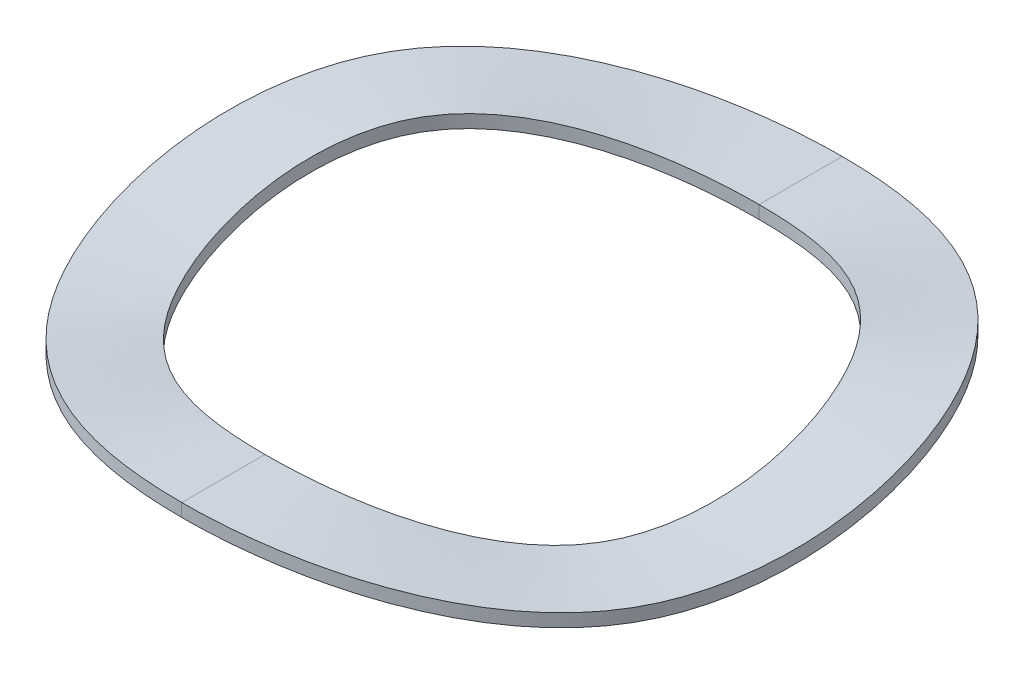
ISO-10303-21;
HEADER;
FILE_DESCRIPTION(('STEP AP214'),'2;1');
FILE_NAME('part.step','',(''),(''),'','','');
FILE_SCHEMA(('AUTOMOTIVE_DESIGN { 1 0 10303 214 1 1 1 1 }'));
ENDSEC;
DATA;
#1=APPLICATION_CONTEXT('core data for automotive mechanical design processes');
#2=APPLICATION_PROTOCOL_DEFINITION('international standard','automotive_design',2000,#1);
#3=PRODUCT_CONTEXT('',#1,'mechanical');
#4=PRODUCT('Part','Part','',(#3));
#5=PRODUCT_RELATED_PRODUCT_CATEGORY('part','',(#4));
#6=PRODUCT_DEFINITION_FORMATION('','',#4);
#7=PRODUCT_DEFINITION_CONTEXT('part definition',#1,'design');
#8=PRODUCT_DEFINITION('design','',#6,#7);
#9=PRODUCT_DEFINITION_SHAPE('','',#8);
#10=(LENGTH_UNIT() NAMED_UNIT(*) SI_UNIT(.MILLI.,.METRE.));
#11=(NAMED_UNIT(*) PLANE_ANGLE_UNIT() SI_UNIT($,.RADIAN.));
#12=(NAMED_UNIT(*) SI_UNIT($,.STERADIAN.) SOLID_ANGLE_UNIT());
#13=UNCERTAINTY_MEASURE_WITH_UNIT(LENGTH_MEASURE(1.E-05),#10,'distance_accuracy_value','');
#14=(GEOMETRIC_REPRESENTATION_CONTEXT(3) GLOBAL_UNCERTAINTY_ASSIGNED_CONTEXT((#13)) GLOBAL_UNIT_ASSIGNED_CONTEXT((#10,
#11,#12)) REPRESENTATION_CONTEXT('',''));
#15=CARTESIAN_POINT('',(0.,0.,0.));
#16=DIRECTION('',(0.,0.,1.));
#17=DIRECTION('',(1.,0.,0.));
#18=AXIS2_PLACEMENT_3D('',#15,#16,#17);
#19=CARTESIAN_POINT('',(0.,1.1938,9.652));
#20=CARTESIAN_POINT('',(-3.34355087893,1.1938,9.652));
#21=CARTESIAN_POINT('',(-10.0306526368,-1.1938,5.7912));
#22=CARTESIAN_POINT('',(-10.0306526368,2.3876,-5.7912));
#23=CARTESIAN_POINT('',(-3.34355087893,0.,-9.652));
#24=CARTESIAN_POINT('',(0.,0.,-9.652));
#25=CARTESIAN_POINT('',(0.,1.1938,10.7357333333));
#26=CARTESIAN_POINT('',(-3.71896711797,1.1938,10.7357333333));
#27=CARTESIAN_POINT('',(-11.1569013539,-1.1938,6.44144));
#28=CARTESIAN_POINT('',(-11.1569013539,2.3876,-6.44144));
#29=CARTESIAN_POINT('',(-3.71896711797,0.,-10.7357333333));
#30=CARTESIAN_POINT('',(0.,0.,-10.7357333333));
#31=CARTESIAN_POINT('',(0.,1.1938,11.8194666667));
#32=CARTESIAN_POINT('',(-4.09438335701,1.1938,11.8194666667));
#33=CARTESIAN_POINT('',(-12.283150071,-1.1938,7.09168));
#34=CARTESIAN_POINT('',(-12.283150071,2.3876,-7.09168));
#35=CARTESIAN_POINT('',(-4.09438335701,0.,-11.8194666667));
#36=CARTESIAN_POINT('',(0.,0.,-11.8194666667));
#37=CARTESIAN_POINT('',(0.,1.1938,12.9032));
#38=CARTESIAN_POINT('',(-4.46979959604,1.1938,12.9032));
#39=CARTESIAN_POINT('',(-13.4093987881,-1.1938,7.74192));
#40=CARTESIAN_POINT('',(-13.4093987881,2.3876,-7.74192));
#41=CARTESIAN_POINT('',(-4.46979959604,0.,-12.9032));
#42=CARTESIAN_POINT('',(0.,0.,-12.9032));
#43=B_SPLINE_SURFACE_WITH_KNOTS('',3,3,((#19,#20,#21,#22,#23,#24),(#25,#26,#27,#28,#29,#30),
(#31,#32,#33,#34,#35,#36),(#37,#38,#39,#40,#41,#42)),.UNSPECIFIED.,.F.,.F.,.F.,(4,4),(4,1,1,4),
(0.,3.58711466601),(37.4440665336,49.9254220448,62.406777556,74.8881330672),.UNSPECIFIED.);
#44=CARTESIAN_POINT('',(0.,1.1938,12.9032));
#45=CARTESIAN_POINT('',(-4.46979959604,1.1938,12.9032));
#46=CARTESIAN_POINT('',(-13.4093987881,-1.1938,7.74192));
#47=CARTESIAN_POINT('',(-13.4093987881,2.3876,-7.74192));
#48=CARTESIAN_POINT('',(-4.46979959604,0.,-12.9032));
#49=CARTESIAN_POINT('',(0.,0.,-12.9032));
#50=B_SPLINE_CURVE_WITH_KNOTS('',3,(#44,#45,#46,#47,#48,#49),.UNSPECIFIED.,.F.,.F.,(4,1,1,4),
(42.7114287966,56.9485717288,71.185714661,85.4228575932),.UNSPECIFIED.);
#51=CARTESIAN_POINT('',(0.,0.,-12.9032));
#52=VERTEX_POINT('',#51);
#53=CARTESIAN_POINT('',(0.,1.1938,12.9032));
#54=VERTEX_POINT('',#53);
#55=EDGE_CURVE('E23',#52,#54,#50,.F.);
#56=DIRECTION('',(0.,0.,-1.));
#57=VECTOR('',#56,1.);
#58=CARTESIAN_POINT('',(0.,0.,-11.2776));
#59=LINE('',#58,#57);
#60=CARTESIAN_POINT('',(0.,0.,-9.652));
#61=VERTEX_POINT('',#60);
#62=EDGE_CURVE('E69',#61,#52,#59,.T.);
#63=CARTESIAN_POINT('',(0.,1.1938,9.652));
#64=CARTESIAN_POINT('',(-3.34355087893,1.1938,9.652));
#65=CARTESIAN_POINT('',(-10.0306526368,-1.1938,5.7912));
#66=CARTESIAN_POINT('',(-10.0306526368,2.3876,-5.7912));
#67=CARTESIAN_POINT('',(-3.34355087893,0.,-9.652));
#68=CARTESIAN_POINT('',(0.,0.,-9.652));
#69=B_SPLINE_CURVE_WITH_KNOTS('',3,(#63,#64,#65,#66,#67,#68),.UNSPECIFIED.,.F.,.F.,(4,1,1,4),
(32.1847707732,42.9130276976,53.641284622,64.3695415464),.UNSPECIFIED.);
#70=CARTESIAN_POINT('',(0.,1.1938,9.652));
#71=VERTEX_POINT('',#70);
#72=EDGE_CURVE('E64',#71,#61,#69,.T.);
#73=DIRECTION('',(0.,0.,-1.));
#74=VECTOR('',#73,1.);
#75=CARTESIAN_POINT('',(0.,1.1938,11.2776));
#76=LINE('',#75,#74);
#77=EDGE_CURVE('E66',#54,#71,#76,.T.);
#78=ORIENTED_EDGE('',*,*,#55,.F.);
#79=ORIENTED_EDGE('',*,*,#62,.F.);
#80=ORIENTED_EDGE('',*,*,#72,.F.);
#81=ORIENTED_EDGE('',*,*,#77,.F.);
#82=EDGE_LOOP('',(#78,#79,#80,#81));
#83=FACE_BOUND('',#82,.T.);
#84=ADVANCED_FACE('F17',(#83),#43,.T.);
#85=CARTESIAN_POINT('',(0.,1.1938,12.9032));
#86=CARTESIAN_POINT('',(-4.46979959604,1.1938,12.9032));
#87=CARTESIAN_POINT('',(-13.4093987881,-1.1938,7.74192));
#88=CARTESIAN_POINT('',(-13.4093987881,2.3876,-7.74192));
#89=CARTESIAN_POINT('',(-4.46979959604,0.,-12.9032));
#90=CARTESIAN_POINT('',(0.,0.,-12.9032));
#91=CARTESIAN_POINT('',(0.,1.36313333333,12.9032));
#92=CARTESIAN_POINT('',(-4.46979959604,1.36313333333,12.9032));
#93=CARTESIAN_POINT('',(-13.4093987881,-1.02446666667,7.74192));
#94=CARTESIAN_POINT('',(-13.4093987881,2.55693333333,-7.74192));
#95=CARTESIAN_POINT('',(-4.46979959604,0.169333333333,-12.9032));
#96=CARTESIAN_POINT('',(0.,0.169333333333,-12.9032));
#97=CARTESIAN_POINT('',(0.,1.53246666667,12.9032));
#98=CARTESIAN_POINT('',(-4.46979959604,1.53246666667,12.9032));
#99=CARTESIAN_POINT('',(-13.4093987881,-0.855133333333,7.74192));
#100=CARTESIAN_POINT('',(-13.4093987881,2.72626666667,-7.74192));
#101=CARTESIAN_POINT('',(-4.46979959604,0.338666666667,-12.9032));
#102=CARTESIAN_POINT('',(0.,0.338666666667,-12.9032));
#103=CARTESIAN_POINT('',(0.,1.7018,12.9032));
#104=CARTESIAN_POINT('',(-4.46979959604,1.7018,12.9032));
#105=CARTESIAN_POINT('',(-13.4093987881,-0.6858,7.74192));
#106=CARTESIAN_POINT('',(-13.4093987881,2.8956,-7.74192));
#107=CARTESIAN_POINT('',(-4.46979959604,0.508,-12.9032));
#108=CARTESIAN_POINT('',(0.,0.508,-12.9032));
#109=B_SPLINE_SURFACE_WITH_KNOTS('',3,3,((#85,#86,#87,#88,#89,#90),(#91,#92,#93,#94,#95,#96),
(#97,#98,#99,#100,#101,#102),(#103,#104,#105,#106,#107,#108)),.UNSPECIFIED.,.F.,.F.,.F.,(4,4),
(4,1,1,4),(0.,0.508),(42.7114287966,56.9485717288,71.185714661,85.4228575932),.UNSPECIFIED.);
#110=CARTESIAN_POINT('',(0.,1.7018,12.9032));
#111=CARTESIAN_POINT('',(-4.46979959604,1.7018,12.9032));
#112=CARTESIAN_POINT('',(-13.4093987881,-0.6858,7.74192));
#113=CARTESIAN_POINT('',(-13.4093987881,2.8956,-7.74192));
#114=CARTESIAN_POINT('',(-4.46979959604,0.508,-12.9032));
#115=CARTESIAN_POINT('',(0.,0.508,-12.9032));
#116=B_SPLINE_CURVE_WITH_KNOTS('',3,(#110,#111,#112,#113,#114,#115),.UNSPECIFIED.,.F.,.F.,(4,1,
1,4),(37.4440665336,49.9254220448,62.406777556,74.8881330672),.UNSPECIFIED.);
#117=CARTESIAN_POINT('',(0.,0.508,-12.9032));
#118=VERTEX_POINT('',#117);
#119=CARTESIAN_POINT('',(0.,1.7018,12.9032));
#120=VERTEX_POINT('',#119);
#121=EDGE_CURVE('E106',#118,#120,#116,.F.);
#122=DIRECTION('',(0.,1.,0.));
#123=VECTOR('',#122,1.);
#124=CARTESIAN_POINT('',(0.,0.254,-12.9032));
#125=LINE('',#124,#123);
#126=EDGE_CURVE('E100',#52,#118,#125,.T.);
#127=DIRECTION('',(0.,-1.,0.));
#128=VECTOR('',#127,1.);
#129=CARTESIAN_POINT('',(0.,1.4478,12.9032));
#130=LINE('',#129,#128);
#131=EDGE_CURVE('E95',#120,#54,#130,.T.);
#132=ORIENTED_EDGE('',*,*,#121,.F.);
#133=ORIENTED_EDGE('',*,*,#126,.F.);
#134=ORIENTED_EDGE('',*,*,#55,.T.);
#135=ORIENTED_EDGE('',*,*,#131,.F.);
#136=EDGE_LOOP('',(#132,#133,#134,#135));
#137=FACE_BOUND('',#136,.T.);
#138=ADVANCED_FACE('F150',(#137),#109,.T.);
#139=CARTESIAN_POINT('',(0.,1.7018,9.652));
#140=CARTESIAN_POINT('',(-3.34355087893,1.7018,9.652));
#141=CARTESIAN_POINT('',(-10.0306526368,-0.6858,5.7912));
#142=CARTESIAN_POINT('',(-10.0306526368,2.8956,-5.7912));
#143=CARTESIAN_POINT('',(-3.34355087893,0.508,-9.652));
#144=CARTESIAN_POINT('',(0.,0.508,-9.652));
#145=CARTESIAN_POINT('',(0.,1.53246666667,9.652));
#146=CARTESIAN_POINT('',(-3.34355087893,1.53246666667,9.652));
#147=CARTESIAN_POINT('',(-10.0306526368,-0.855133333333,5.7912));
#148=CARTESIAN_POINT('',(-10.0306526368,2.72626666667,-5.7912));
#149=CARTESIAN_POINT('',(-3.34355087893,0.338666666667,-9.652));
#150=CARTESIAN_POINT('',(0.,0.338666666667,-9.652));
#151=CARTESIAN_POINT('',(0.,1.36313333333,9.652));
#152=CARTESIAN_POINT('',(-3.34355087893,1.36313333333,9.652));
#153=CARTESIAN_POINT('',(-10.0306526368,-1.02446666667,5.7912));
#154=CARTESIAN_POINT('',(-10.0306526368,2.55693333333,-5.7912));
#155=CARTESIAN_POINT('',(-3.34355087893,0.169333333333,-9.652));
#156=CARTESIAN_POINT('',(0.,0.169333333333,-9.652));
#157=CARTESIAN_POINT('',(0.,1.1938,9.652));
#158=CARTESIAN_POINT('',(-3.34355087893,1.1938,9.652));
#159=CARTESIAN_POINT('',(-10.0306526368,-1.1938,5.7912));
#160=CARTESIAN_POINT('',(-10.0306526368,2.3876,-5.7912));
#161=CARTESIAN_POINT('',(-3.34355087893,0.,-9.652));
#162=CARTESIAN_POINT('',(0.,0.,-9.652));
#163=B_SPLINE_SURFACE_WITH_KNOTS('',3,3,((#139,#140,#141,#142,#143,#144),(#145,#146,#147,#148,
#149,#150),(#151,#152,#153,#154,#155,#156),(#157,#158,#159,#160,#161,#162)),.UNSPECIFIED.,.F.,
.F.,.F.,(4,4),(4,1,1,4),(0.,0.508),(32.1847707732,42.9130276976,53.641284622,64.3695415464),.UNSPECIFIED.);
#164=DIRECTION('',(0.,1.,0.));
#165=VECTOR('',#164,1.);
#166=CARTESIAN_POINT('',(0.,0.254,-9.652));
#167=LINE('',#166,#165);
#168=CARTESIAN_POINT('',(0.,0.508,-9.652));
#169=VERTEX_POINT('',#168);
#170=EDGE_CURVE('E40',#61,#169,#167,.T.);
#171=CARTESIAN_POINT('',(0.,1.7018,9.652));
#172=CARTESIAN_POINT('',(-3.34355087893,1.7018,9.652));
#173=CARTESIAN_POINT('',(-10.0306526368,-0.6858,5.7912));
#174=CARTESIAN_POINT('',(-10.0306526368,2.8956,-5.7912));
#175=CARTESIAN_POINT('',(-3.34355087893,0.508,-9.652));
#176=CARTESIAN_POINT('',(0.,0.508,-9.652));
#177=B_SPLINE_CURVE_WITH_KNOTS('',3,(#171,#172,#173,#174,#175,#176),.UNSPECIFIED.,.F.,.F.,(4,1,
1,4),(37.4440665336,49.9254220448,62.406777556,74.8881330672),.UNSPECIFIED.);
#178=CARTESIAN_POINT('',(0.,1.7018,9.652));
#179=VERTEX_POINT('',#178);
#180=EDGE_CURVE('E77',#179,#169,#177,.T.);
#181=DIRECTION('',(0.,-1.,0.));
#182=VECTOR('',#181,1.);
#183=CARTESIAN_POINT('',(0.,1.4478,9.652));
#184=LINE('',#183,#182);
#185=EDGE_CURVE('E71',#179,#71,#184,.T.);
#186=ORIENTED_EDGE('',*,*,#72,.T.);
#187=ORIENTED_EDGE('',*,*,#170,.T.);
#188=ORIENTED_EDGE('',*,*,#180,.F.);
#189=ORIENTED_EDGE('',*,*,#185,.T.);
#190=EDGE_LOOP('',(#186,#187,#188,#189));
#191=FACE_BOUND('',#190,.T.);
#192=ADVANCED_FACE('F85',(#191),#163,.T.);
#193=CARTESIAN_POINT('',(0.,0.,-9.652));
#194=CARTESIAN_POINT('',(3.34355087893,0.,-9.652));
#195=CARTESIAN_POINT('',(10.0306526368,2.3876,-5.7912));
#196=CARTESIAN_POINT('',(10.0306526368,-1.1938,5.7912));
#197=CARTESIAN_POINT('',(3.34355087893,1.1938,9.652));
#198=CARTESIAN_POINT('',(0.,1.1938,9.652));
#199=CARTESIAN_POINT('',(0.,0.,-10.7357333333));
#200=CARTESIAN_POINT('',(3.71896711797,0.,-10.7357333333));
#201=CARTESIAN_POINT('',(11.1569013539,2.3876,-6.44144));
#202=CARTESIAN_POINT('',(11.1569013539,-1.1938,6.44144));
#203=CARTESIAN_POINT('',(3.71896711797,1.1938,10.7357333333));
#204=CARTESIAN_POINT('',(0.,1.1938,10.7357333333));
#205=CARTESIAN_POINT('',(0.,0.,-11.8194666667));
#206=CARTESIAN_POINT('',(4.09438335701,0.,-11.8194666667));
#207=CARTESIAN_POINT('',(12.283150071,2.3876,-7.09168));
#208=CARTESIAN_POINT('',(12.283150071,-1.1938,7.09168));
#209=CARTESIAN_POINT('',(4.09438335701,1.1938,11.8194666667));
#210=CARTESIAN_POINT('',(0.,1.1938,11.8194666667));
#211=CARTESIAN_POINT('',(0.,0.,-12.9032));
#212=CARTESIAN_POINT('',(4.46979959604,0.,-12.9032));
#213=CARTESIAN_POINT('',(13.4093987881,2.3876,-7.74192));
#214=CARTESIAN_POINT('',(13.4093987881,-1.1938,7.74192));
#215=CARTESIAN_POINT('',(4.46979959604,1.1938,12.9032));
#216=CARTESIAN_POINT('',(0.,1.1938,12.9032));
#217=B_SPLINE_SURFACE_WITH_KNOTS('',3,3,((#193,#194,#195,#196,#197,#198),(#199,#200,#201,#202,
#203,#204),(#205,#206,#207,#208,#209,#210),(#211,#212,#213,#214,#215,#216)),.UNSPECIFIED.,.F.,
.F.,.F.,(4,4),(4,1,1,4),(0.,3.58711466601),(0.,12.4813555112,24.9627110224,37.4440665336),.UNSPECIFIED.);
#218=CARTESIAN_POINT('',(0.,0.,-12.9032));
#219=CARTESIAN_POINT('',(4.46979959604,0.,-12.9032));
#220=CARTESIAN_POINT('',(13.4093987881,2.3876,-7.74192));
#221=CARTESIAN_POINT('',(13.4093987881,-1.1938,7.74192));
#222=CARTESIAN_POINT('',(4.46979959604,1.1938,12.9032));
#223=CARTESIAN_POINT('',(0.,1.1938,12.9032));
#224=B_SPLINE_CURVE_WITH_KNOTS('',3,(#218,#219,#220,#221,#222,#223),.UNSPECIFIED.,.F.,.F.,(4,1,
1,4),(0.,14.2371429322,28.4742858644,42.7114287966),.UNSPECIFIED.);
#225=EDGE_CURVE('E82',#54,#52,#224,.F.);
#226=CARTESIAN_POINT('',(0.,0.,-9.652));
#227=CARTESIAN_POINT('',(3.34355087893,0.,-9.652));
#228=CARTESIAN_POINT('',(10.0306526368,2.3876,-5.7912));
#229=CARTESIAN_POINT('',(10.0306526368,-1.1938,5.7912));
#230=CARTESIAN_POINT('',(3.34355087893,1.1938,9.652));
#231=CARTESIAN_POINT('',(0.,1.1938,9.652));
#232=B_SPLINE_CURVE_WITH_KNOTS('',3,(#226,#227,#228,#229,#230,#231),.UNSPECIFIED.,.F.,.F.,(4,1,
1,4),(0.,10.7282569244,21.4565138488,32.1847707732),.UNSPECIFIED.);
#233=EDGE_CURVE('E73',#61,#71,#232,.T.);
#234=ORIENTED_EDGE('',*,*,#62,.T.);
#235=ORIENTED_EDGE('',*,*,#225,.F.);
#236=ORIENTED_EDGE('',*,*,#77,.T.);
#237=ORIENTED_EDGE('',*,*,#233,.F.);
#238=EDGE_LOOP('',(#234,#235,#236,#237));
#239=FACE_BOUND('',#238,.T.);
#240=ADVANCED_FACE('F80',(#239),#217,.T.);
#241=CARTESIAN_POINT('',(0.,0.,-12.9032));
#242=CARTESIAN_POINT('',(4.46979959604,0.,-12.9032));
#243=CARTESIAN_POINT('',(13.4093987881,2.3876,-7.74192));
#244=CARTESIAN_POINT('',(13.4093987881,-1.1938,7.74192));
#245=CARTESIAN_POINT('',(4.46979959604,1.1938,12.9032));
#246=CARTESIAN_POINT('',(0.,1.1938,12.9032));
#247=CARTESIAN_POINT('',(0.,0.169333333333,-12.9032));
#248=CARTESIAN_POINT('',(4.46979959604,0.169333333333,-12.9032));
#249=CARTESIAN_POINT('',(13.4093987881,2.55693333333,-7.74192));
#250=CARTESIAN_POINT('',(13.4093987881,-1.02446666667,7.74192));
#251=CARTESIAN_POINT('',(4.46979959604,1.36313333333,12.9032));
#252=CARTESIAN_POINT('',(0.,1.36313333333,12.9032));
#253=CARTESIAN_POINT('',(0.,0.338666666667,-12.9032));
#254=CARTESIAN_POINT('',(4.46979959604,0.338666666667,-12.9032));
#255=CARTESIAN_POINT('',(13.4093987881,2.72626666667,-7.74192));
#256=CARTESIAN_POINT('',(13.4093987881,-0.855133333333,7.74192));
#257=CARTESIAN_POINT('',(4.46979959604,1.53246666667,12.9032));
#258=CARTESIAN_POINT('',(0.,1.53246666667,12.9032));
#259=CARTESIAN_POINT('',(0.,0.508,-12.9032));
#260=CARTESIAN_POINT('',(4.46979959604,0.508,-12.9032));
#261=CARTESIAN_POINT('',(13.4093987881,2.8956,-7.74192));
#262=CARTESIAN_POINT('',(13.4093987881,-0.6858,7.74192));
#263=CARTESIAN_POINT('',(4.46979959604,1.7018,12.9032));
#264=CARTESIAN_POINT('',(0.,1.7018,12.9032));
#265=B_SPLINE_SURFACE_WITH_KNOTS('',3,3,((#241,#242,#243,#244,#245,#246),(#247,#248,#249,#250,
#251,#252),(#253,#254,#255,#256,#257,#258),(#259,#260,#261,#262,#263,#264)),.UNSPECIFIED.,.F.,
.F.,.F.,(4,4),(4,1,1,4),(0.,0.508),(0.,14.2371429322,28.4742858644,42.7114287966),.UNSPECIFIED.);
#266=CARTESIAN_POINT('',(0.,0.508,-12.9032));
#267=CARTESIAN_POINT('',(4.46979959604,0.508,-12.9032));
#268=CARTESIAN_POINT('',(13.4093987881,2.8956,-7.74192));
#269=CARTESIAN_POINT('',(13.4093987881,-0.6858,7.74192));
#270=CARTESIAN_POINT('',(4.46979959604,1.7018,12.9032));
#271=CARTESIAN_POINT('',(0.,1.7018,12.9032));
#272=B_SPLINE_CURVE_WITH_KNOTS('',3,(#266,#267,#268,#269,#270,#271),.UNSPECIFIED.,.F.,.F.,(4,1,
1,4),(0.,12.4813555112,24.9627110224,37.4440665336),.UNSPECIFIED.);
#273=EDGE_CURVE('E127',#120,#118,#272,.F.);
#274=ORIENTED_EDGE('',*,*,#126,.T.);
#275=ORIENTED_EDGE('',*,*,#273,.F.);
#276=ORIENTED_EDGE('',*,*,#131,.T.);
#277=ORIENTED_EDGE('',*,*,#225,.T.);
#278=EDGE_LOOP('',(#274,#275,#276,#277));
#279=FACE_BOUND('',#278,.T.);
#280=ADVANCED_FACE('F149',(#279),#265,.T.);
#281=CARTESIAN_POINT('',(0.,1.7018,12.9032));
#282=CARTESIAN_POINT('',(-4.46979959604,1.7018,12.9032));
#283=CARTESIAN_POINT('',(-13.4093987881,-0.6858,7.74192));
#284=CARTESIAN_POINT('',(-13.4093987881,2.8956,-7.74192));
#285=CARTESIAN_POINT('',(-4.46979959604,0.508,-12.9032));
#286=CARTESIAN_POINT('',(0.,0.508,-12.9032));
#287=CARTESIAN_POINT('',(0.,1.7018,11.8194666667));
#288=CARTESIAN_POINT('',(-4.09438335701,1.7018,11.8194666667));
#289=CARTESIAN_POINT('',(-12.283150071,-0.6858,7.09168));
#290=CARTESIAN_POINT('',(-12.283150071,2.8956,-7.09168));
#291=CARTESIAN_POINT('',(-4.09438335701,0.508,-11.8194666667));
#292=CARTESIAN_POINT('',(0.,0.508,-11.8194666667));
#293=CARTESIAN_POINT('',(0.,1.7018,10.7357333333));
#294=CARTESIAN_POINT('',(-3.71896711797,1.7018,10.7357333333));
#295=CARTESIAN_POINT('',(-11.1569013539,-0.6858,6.44144));
#296=CARTESIAN_POINT('',(-11.1569013539,2.8956,-6.44144));
#297=CARTESIAN_POINT('',(-3.71896711797,0.508,-10.7357333333));
#298=CARTESIAN_POINT('',(0.,0.508,-10.7357333333));
#299=CARTESIAN_POINT('',(0.,1.7018,9.652));
#300=CARTESIAN_POINT('',(-3.34355087893,1.7018,9.652));
#301=CARTESIAN_POINT('',(-10.0306526368,-0.6858,5.7912));
#302=CARTESIAN_POINT('',(-10.0306526368,2.8956,-5.7912));
#303=CARTESIAN_POINT('',(-3.34355087893,0.508,-9.652));
#304=CARTESIAN_POINT('',(0.,0.508,-9.652));
#305=B_SPLINE_SURFACE_WITH_KNOTS('',3,3,((#281,#282,#283,#284,#285,#286),(#287,#288,#289,#290,
#291,#292),(#293,#294,#295,#296,#297,#298),(#299,#300,#301,#302,#303,#304)),.UNSPECIFIED.,.F.,
.F.,.F.,(4,4),(4,1,1,4),(0.,3.58711466601),(37.4440665336,49.9254220448,62.406777556,
74.8881330672),.UNSPECIFIED.);
#306=DIRECTION('',(0.,0.,1.));
#307=VECTOR('',#306,1.);
#308=CARTESIAN_POINT('',(0.,0.508,-11.2776));
#309=LINE('',#308,#307);
#310=EDGE_CURVE('E31',#118,#169,#309,.T.);
#311=DIRECTION('',(0.,0.,1.));
#312=VECTOR('',#311,1.);
#313=CARTESIAN_POINT('',(0.,1.7018,11.2776));
#314=LINE('',#313,#312);
#315=EDGE_CURVE('E76',#179,#120,#314,.T.);
#316=ORIENTED_EDGE('',*,*,#180,.T.);
#317=ORIENTED_EDGE('',*,*,#310,.F.);
#318=ORIENTED_EDGE('',*,*,#121,.T.);
#319=ORIENTED_EDGE('',*,*,#315,.F.);
#320=EDGE_LOOP('',(#316,#317,#318,#319));
#321=FACE_BOUND('',#320,.T.);
#322=ADVANCED_FACE('F145',(#321),#305,.T.);
#323=CARTESIAN_POINT('',(0.,0.508,-9.652));
#324=CARTESIAN_POINT('',(3.34355087893,0.508,-9.652));
#325=CARTESIAN_POINT('',(10.0306526368,2.8956,-5.7912));
#326=CARTESIAN_POINT('',(10.0306526368,-0.6858,5.7912));
#327=CARTESIAN_POINT('',(3.34355087893,1.7018,9.652));
#328=CARTESIAN_POINT('',(0.,1.7018,9.652));
#329=CARTESIAN_POINT('',(0.,0.338666666667,-9.652));
#330=CARTESIAN_POINT('',(3.34355087893,0.338666666667,-9.652));
#331=CARTESIAN_POINT('',(10.0306526368,2.72626666667,-5.7912));
#332=CARTESIAN_POINT('',(10.0306526368,-0.855133333333,5.7912));
#333=CARTESIAN_POINT('',(3.34355087893,1.53246666667,9.652));
#334=CARTESIAN_POINT('',(0.,1.53246666667,9.652));
#335=CARTESIAN_POINT('',(0.,0.169333333333,-9.652));
#336=CARTESIAN_POINT('',(3.34355087893,0.169333333333,-9.652));
#337=CARTESIAN_POINT('',(10.0306526368,2.55693333333,-5.7912));
#338=CARTESIAN_POINT('',(10.0306526368,-1.02446666667,5.7912));
#339=CARTESIAN_POINT('',(3.34355087893,1.36313333333,9.652));
#340=CARTESIAN_POINT('',(0.,1.36313333333,9.652));
#341=CARTESIAN_POINT('',(0.,0.,-9.652));
#342=CARTESIAN_POINT('',(3.34355087893,0.,-9.652));
#343=CARTESIAN_POINT('',(10.0306526368,2.3876,-5.7912));
#344=CARTESIAN_POINT('',(10.0306526368,-1.1938,5.7912));
#345=CARTESIAN_POINT('',(3.34355087893,1.1938,9.652));
#346=CARTESIAN_POINT('',(0.,1.1938,9.652));
#347=B_SPLINE_SURFACE_WITH_KNOTS('',3,3,((#323,#324,#325,#326,#327,#328),(#329,#330,#331,#332,
#333,#334),(#335,#336,#337,#338,#339,#340),(#341,#342,#343,#344,#345,#346)),.UNSPECIFIED.,.F.,
.F.,.F.,(4,4),(4,1,1,4),(0.,0.508),(0.,10.7282569244,21.4565138488,32.1847707732),.UNSPECIFIED.);
#348=CARTESIAN_POINT('',(0.,0.508,-9.652));
#349=CARTESIAN_POINT('',(3.34355087893,0.508,-9.652));
#350=CARTESIAN_POINT('',(10.0306526368,2.8956,-5.7912));
#351=CARTESIAN_POINT('',(10.0306526368,-0.6858,5.7912));
#352=CARTESIAN_POINT('',(3.34355087893,1.7018,9.652));
#353=CARTESIAN_POINT('',(0.,1.7018,9.652));
#354=B_SPLINE_CURVE_WITH_KNOTS('',3,(#348,#349,#350,#351,#352,#353),.UNSPECIFIED.,.F.,.F.,(4,1,
1,4),(0.,12.4813555112,24.9627110224,37.4440665336),.UNSPECIFIED.);
#355=EDGE_CURVE('E11',#169,#179,#354,.T.);
#356=ORIENTED_EDGE('',*,*,#170,.F.);
#357=ORIENTED_EDGE('',*,*,#233,.T.);
#358=ORIENTED_EDGE('',*,*,#185,.F.);
#359=ORIENTED_EDGE('',*,*,#355,.F.);
#360=EDGE_LOOP('',(#356,#357,#358,#359));
#361=FACE_BOUND('',#360,.T.);
#362=ADVANCED_FACE('F74',(#361),#347,.T.);
#363=CARTESIAN_POINT('',(0.,0.508,-12.9032));
#364=CARTESIAN_POINT('',(4.46979959604,0.508,-12.9032));
#365=CARTESIAN_POINT('',(13.4093987881,2.8956,-7.74192));
#366=CARTESIAN_POINT('',(13.4093987881,-0.6858,7.74192));
#367=CARTESIAN_POINT('',(4.46979959604,1.7018,12.9032));
#368=CARTESIAN_POINT('',(0.,1.7018,12.9032));
#369=CARTESIAN_POINT('',(0.,0.508,-11.8194666667));
#370=CARTESIAN_POINT('',(4.09438335701,0.508,-11.8194666667));
#371=CARTESIAN_POINT('',(12.283150071,2.8956,-7.09168));
#372=CARTESIAN_POINT('',(12.283150071,-0.6858,7.09168));
#373=CARTESIAN_POINT('',(4.09438335701,1.7018,11.8194666667));
#374=CARTESIAN_POINT('',(0.,1.7018,11.8194666667));
#375=CARTESIAN_POINT('',(0.,0.508,-10.7357333333));
#376=CARTESIAN_POINT('',(3.71896711797,0.508,-10.7357333333));
#377=CARTESIAN_POINT('',(11.1569013539,2.8956,-6.44144));
#378=CARTESIAN_POINT('',(11.1569013539,-0.6858,6.44144));
#379=CARTESIAN_POINT('',(3.71896711797,1.7018,10.7357333333));
#380=CARTESIAN_POINT('',(0.,1.7018,10.7357333333));
#381=CARTESIAN_POINT('',(0.,0.508,-9.652));
#382=CARTESIAN_POINT('',(3.34355087893,0.508,-9.652));
#383=CARTESIAN_POINT('',(10.0306526368,2.8956,-5.7912));
#384=CARTESIAN_POINT('',(10.0306526368,-0.6858,5.7912));
#385=CARTESIAN_POINT('',(3.34355087893,1.7018,9.652));
#386=CARTESIAN_POINT('',(0.,1.7018,9.652));
#387=B_SPLINE_SURFACE_WITH_KNOTS('',3,3,((#363,#364,#365,#366,#367,#368),(#369,#370,#371,#372,
#373,#374),(#375,#376,#377,#378,#379,#380),(#381,#382,#383,#384,#385,#386)),.UNSPECIFIED.,.F.,
.F.,.F.,(4,4),(4,1,1,4),(0.,3.58711466601),(0.,12.4813555112,24.9627110224,37.4440665336),.UNSPECIFIED.);
#388=ORIENTED_EDGE('',*,*,#310,.T.);
#389=ORIENTED_EDGE('',*,*,#355,.T.);
#390=ORIENTED_EDGE('',*,*,#315,.T.);
#391=ORIENTED_EDGE('',*,*,#273,.T.);
#392=EDGE_LOOP('',(#388,#389,#390,#391));
#393=FACE_BOUND('',#392,.T.);
#394=ADVANCED_FACE('F19',(#393),#387,.T.);
#395=CLOSED_SHELL('',(#84,#138,#192,#240,#280,#322,#362,#394));
#396=MANIFOLD_SOLID_BREP('B1',#395);
#397=ADVANCED_BREP_SHAPE_REPRESENTATION('',(#18,#396),#14);
#398=SHAPE_DEFINITION_REPRESENTATION(#9,#397);
ENDSEC;
END-ISO-10303-21;
